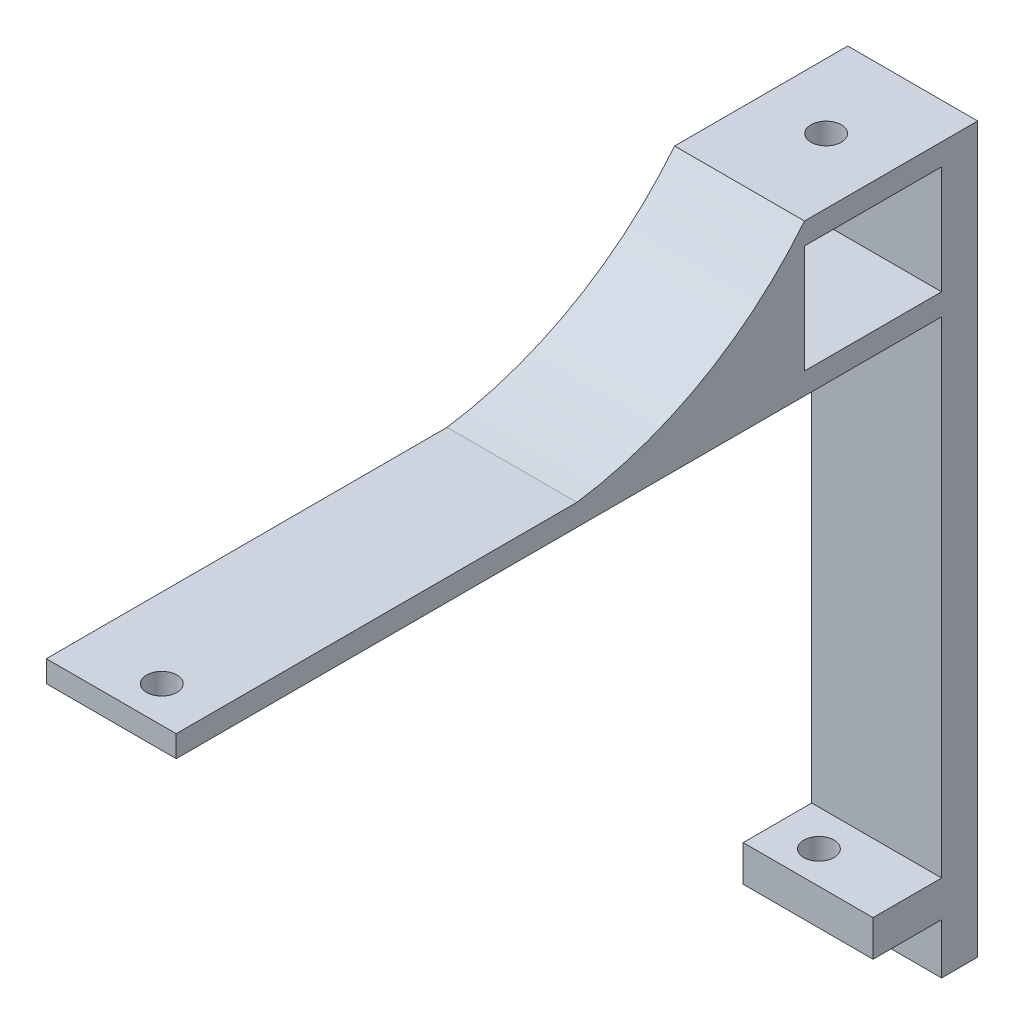
ISO-10303-21;
HEADER;
FILE_DESCRIPTION(('STEP AP214'),'2;1');
FILE_NAME('part.step','',(''),(''),'','','');
FILE_SCHEMA(('AUTOMOTIVE_DESIGN { 1 0 10303 214 1 1 1 1 }'));
ENDSEC;
DATA;
#1=APPLICATION_CONTEXT('core data for automotive mechanical design processes');
#2=APPLICATION_PROTOCOL_DEFINITION('international standard','automotive_design',2000,#1);
#3=PRODUCT_CONTEXT('',#1,'mechanical');
#4=PRODUCT('Part','Part','',(#3));
#5=PRODUCT_RELATED_PRODUCT_CATEGORY('part','',(#4));
#6=PRODUCT_DEFINITION_FORMATION('','',#4);
#7=PRODUCT_DEFINITION_CONTEXT('part definition',#1,'design');
#8=PRODUCT_DEFINITION('design','',#6,#7);
#9=PRODUCT_DEFINITION_SHAPE('','',#8);
#10=(LENGTH_UNIT() NAMED_UNIT(*) SI_UNIT(.MILLI.,.METRE.));
#11=(NAMED_UNIT(*) PLANE_ANGLE_UNIT() SI_UNIT($,.RADIAN.));
#12=(NAMED_UNIT(*) SI_UNIT($,.STERADIAN.) SOLID_ANGLE_UNIT());
#13=UNCERTAINTY_MEASURE_WITH_UNIT(LENGTH_MEASURE(1.E-05),#10,'distance_accuracy_value','');
#14=(GEOMETRIC_REPRESENTATION_CONTEXT(3) GLOBAL_UNCERTAINTY_ASSIGNED_CONTEXT((#13)) GLOBAL_UNIT_ASSIGNED_CONTEXT((#10,
#11,#12)) REPRESENTATION_CONTEXT('',''));
#15=CARTESIAN_POINT('',(0.,0.,0.));
#16=DIRECTION('',(0.,0.,1.));
#17=DIRECTION('',(1.,0.,0.));
#18=AXIS2_PLACEMENT_3D('',#15,#16,#17);
#19=CARTESIAN_POINT('',(52.,192.414352888303,0.));
#20=DIRECTION('',(0.,1.,0.));
#21=DIRECTION('',(0.,0.,1.));
#22=AXIS2_PLACEMENT_3D('',#19,#20,#21);
#23=PLANE('',#22);
#24=DIRECTION('',(1.,0.,0.));
#25=VECTOR('',#24,1.);
#26=CARTESIAN_POINT('',(-24.376584513286,192.414352888303,-32.6395852545773));
#27=LINE('',#26,#25);
#28=CARTESIAN_POINT('',(34.,192.414352888303,-32.6395852545773));
#29=VERTEX_POINT('',#28);
#30=CARTESIAN_POINT('',(52.,192.414352888303,-32.6395852545773));
#31=VERTEX_POINT('',#30);
#32=EDGE_CURVE('E308',#29,#31,#27,.T.);
#33=ORIENTED_EDGE('',*,*,#32,.F.);
#34=DIRECTION('',(0.,0.,-1.));
#35=VECTOR('',#34,1.);
#36=CARTESIAN_POINT('',(34.,192.414352888303,0.));
#37=LINE('',#36,#35);
#38=CARTESIAN_POINT('',(34.,192.414352888303,-13.6395852545773));
#39=VERTEX_POINT('',#38);
#40=EDGE_CURVE('E333',#39,#29,#37,.T.);
#41=ORIENTED_EDGE('',*,*,#40,.F.);
#42=DIRECTION('',(1.,0.,0.));
#43=VECTOR('',#42,1.);
#44=CARTESIAN_POINT('',(-24.376584513286,192.414352888303,-13.6395852545773));
#45=LINE('',#44,#43);
#46=CARTESIAN_POINT('',(52.,192.414352888303,-13.6395852545773));
#47=VERTEX_POINT('',#46);
#48=EDGE_CURVE('E89',#39,#47,#45,.T.);
#49=ORIENTED_EDGE('',*,*,#48,.T.);
#50=DIRECTION('',(0.,0.,-1.));
#51=VECTOR('',#50,1.);
#52=CARTESIAN_POINT('',(52.,192.414352888303,0.));
#53=LINE('',#52,#51);
#54=EDGE_CURVE('E270',#47,#31,#53,.T.);
#55=ORIENTED_EDGE('',*,*,#54,.T.);
#56=EDGE_LOOP('',(#33,#41,#49,#55));
#57=FACE_BOUND('',#56,.T.);
#58=ADVANCED_FACE('F65',(#57),#23,.T.);
#59=CARTESIAN_POINT('',(52.,0.,73.4248216350618));
#60=DIRECTION('',(0.,0.,-1.));
#61=DIRECTION('',(-1.,0.,0.));
#62=AXIS2_PLACEMENT_3D('',#59,#60,#61);
#63=PLANE('',#62);
#64=DIRECTION('',(-1.,0.,0.));
#65=VECTOR('',#64,1.);
#66=CARTESIAN_POINT('',(52.,192.414352888303,73.4248216350618));
#67=LINE('',#66,#65);
#68=CARTESIAN_POINT('',(52.,192.414352888303,73.4248216350618));
#69=VERTEX_POINT('',#68);
#70=CARTESIAN_POINT('',(34.,192.414352888303,73.4248216350618));
#71=VERTEX_POINT('',#70);
#72=EDGE_CURVE('E232',#69,#71,#67,.T.);
#73=ORIENTED_EDGE('',*,*,#72,.T.);
#74=DIRECTION('',(0.,-1.,0.));
#75=VECTOR('',#74,1.);
#76=CARTESIAN_POINT('',(34.,0.,73.4248216350618));
#77=LINE('',#76,#75);
#78=CARTESIAN_POINT('',(34.,189.414352888303,73.4248216350618));
#79=VERTEX_POINT('',#78);
#80=EDGE_CURVE('E227',#71,#79,#77,.T.);
#81=ORIENTED_EDGE('',*,*,#80,.T.);
#82=DIRECTION('',(-1.,0.,0.));
#83=VECTOR('',#82,1.);
#84=CARTESIAN_POINT('',(52.,189.414352888303,73.4248216350618));
#85=LINE('',#84,#83);
#86=CARTESIAN_POINT('',(52.,189.414352888303,73.4248216350618));
#87=VERTEX_POINT('',#86);
#88=EDGE_CURVE('E231',#87,#79,#85,.T.);
#89=ORIENTED_EDGE('',*,*,#88,.F.);
#90=DIRECTION('',(0.,-1.,0.));
#91=VECTOR('',#90,1.);
#92=CARTESIAN_POINT('',(52.,0.,73.4248216350618));
#93=LINE('',#92,#91);
#94=EDGE_CURVE('E222',#69,#87,#93,.T.);
#95=ORIENTED_EDGE('',*,*,#94,.F.);
#96=EDGE_LOOP('',(#73,#81,#89,#95));
#97=FACE_BOUND('',#96,.T.);
#98=ADVANCED_FACE('F67',(#97),#63,.F.);
#99=CARTESIAN_POINT('',(52.,189.414352888303,0.));
#100=DIRECTION('',(0.,1.,0.));
#101=DIRECTION('',(0.,0.,1.));
#102=AXIS2_PLACEMENT_3D('',#99,#100,#101);
#103=PLANE('',#102);
#104=CARTESIAN_POINT('',(45.,189.414352888303,68.4248216350618));
#105=DIRECTION('',(0.,1.,0.));
#106=DIRECTION('',(0.,0.,1.));
#107=AXIS2_PLACEMENT_3D('',#104,#105,#106);
#108=CIRCLE('',#107,2.1);
#109=CARTESIAN_POINT('',(45.,189.414352888303,70.5248216350618));
#110=VERTEX_POINT('',#109);
#111=EDGE_CURVE('E385',#110,#110,#108,.T.);
#112=ORIENTED_EDGE('',*,*,#111,.T.);
#113=EDGE_LOOP('',(#112));
#114=FACE_BOUND('',#113,.T.);
#115=ORIENTED_EDGE('',*,*,#88,.T.);
#116=DIRECTION('',(0.,0.,-1.));
#117=VECTOR('',#116,1.);
#118=CARTESIAN_POINT('',(34.,189.414352888303,0.));
#119=LINE('',#118,#117);
#120=CARTESIAN_POINT('',(34.,189.414352888303,-32.6395852545773));
#121=VERTEX_POINT('',#120);
#122=EDGE_CURVE('E217',#79,#121,#119,.T.);
#123=ORIENTED_EDGE('',*,*,#122,.T.);
#124=DIRECTION('',(-1.,0.,0.));
#125=VECTOR('',#124,1.);
#126=CARTESIAN_POINT('',(52.,189.414352888303,-32.6395852545773));
#127=LINE('',#126,#125);
#128=CARTESIAN_POINT('',(52.,189.414352888303,-32.6395852545773));
#129=VERTEX_POINT('',#128);
#130=EDGE_CURVE('E203',#129,#121,#127,.T.);
#131=ORIENTED_EDGE('',*,*,#130,.F.);
#132=DIRECTION('',(0.,0.,-1.));
#133=VECTOR('',#132,1.);
#134=CARTESIAN_POINT('',(52.,189.414352888303,0.));
#135=LINE('',#134,#133);
#136=EDGE_CURVE('E219',#87,#129,#135,.T.);
#137=ORIENTED_EDGE('',*,*,#136,.F.);
#138=EDGE_LOOP('',(#115,#123,#131,#137));
#139=FACE_BOUND('',#138,.T.);
#140=ADVANCED_FACE('F374',(#114,#139),#103,.F.);
#141=CARTESIAN_POINT('',(52.,0.,-32.6395852545773));
#142=DIRECTION('',(0.,0.,1.));
#143=DIRECTION('',(1.,0.,0.));
#144=AXIS2_PLACEMENT_3D('',#141,#142,#143);
#145=PLANE('',#144);
#146=DIRECTION('',(0.,1.,0.));
#147=VECTOR('',#146,1.);
#148=CARTESIAN_POINT('',(34.,0.,-32.6395852545773));
#149=LINE('',#148,#147);
#150=CARTESIAN_POINT('',(34.,122.064008857799,-32.6395852545773));
#151=VERTEX_POINT('',#150);
#152=EDGE_CURVE('E75',#151,#121,#149,.T.);
#153=ORIENTED_EDGE('',*,*,#152,.F.);
#154=DIRECTION('',(-1.,0.,0.));
#155=VECTOR('',#154,1.);
#156=CARTESIAN_POINT('',(52.,122.064008857799,-32.6395852545773));
#157=LINE('',#156,#155);
#158=CARTESIAN_POINT('',(52.,122.064008857799,-32.6395852545773));
#159=VERTEX_POINT('',#158);
#160=EDGE_CURVE('E202',#159,#151,#157,.T.);
#161=ORIENTED_EDGE('',*,*,#160,.F.);
#162=DIRECTION('',(0.,1.,0.));
#163=VECTOR('',#162,1.);
#164=CARTESIAN_POINT('',(52.,0.,-32.6395852545773));
#165=LINE('',#164,#163);
#166=EDGE_CURVE('E200',#159,#129,#165,.T.);
#167=ORIENTED_EDGE('',*,*,#166,.T.);
#168=ORIENTED_EDGE('',*,*,#130,.T.);
#169=EDGE_LOOP('',(#153,#161,#167,#168));
#170=FACE_BOUND('',#169,.T.);
#171=ADVANCED_FACE('F377',(#170),#145,.T.);
#172=CARTESIAN_POINT('',(52.,122.064008857799,0.));
#173=DIRECTION('',(0.,1.,0.));
#174=DIRECTION('',(0.,0.,1.));
#175=AXIS2_PLACEMENT_3D('',#172,#173,#174);
#176=PLANE('',#175);
#177=CARTESIAN_POINT('',(40.,122.064008857799,-27.6395852545773));
#178=DIRECTION('',(0.,1.,0.));
#179=DIRECTION('',(0.,0.,1.));
#180=AXIS2_PLACEMENT_3D('',#177,#178,#179);
#181=CIRCLE('',#180,2.1);
#182=CARTESIAN_POINT('',(40.,122.064008857799,-25.5395852545773));
#183=VERTEX_POINT('',#182);
#184=EDGE_CURVE('E590',#183,#183,#181,.T.);
#185=ORIENTED_EDGE('',*,*,#184,.F.);
#186=EDGE_LOOP('',(#185));
#187=FACE_BOUND('',#186,.T.);
#188=DIRECTION('',(-1.,0.,0.));
#189=VECTOR('',#188,1.);
#190=CARTESIAN_POINT('',(34.,122.064008857799,-23.1395852545773));
#191=LINE('',#190,#189);
#192=CARTESIAN_POINT('',(52.,122.064008857799,-23.1395852545773));
#193=VERTEX_POINT('',#192);
#194=CARTESIAN_POINT('',(34.,122.064008857799,-23.1395852545773));
#195=VERTEX_POINT('',#194);
#196=EDGE_CURVE('E82',#193,#195,#191,.T.);
#197=ORIENTED_EDGE('',*,*,#196,.F.);
#198=DIRECTION('',(0.,0.,-1.));
#199=VECTOR('',#198,1.);
#200=CARTESIAN_POINT('',(52.,122.064008857799,0.));
#201=LINE('',#200,#199);
#202=EDGE_CURVE('E191',#193,#159,#201,.T.);
#203=ORIENTED_EDGE('',*,*,#202,.T.);
#204=ORIENTED_EDGE('',*,*,#160,.T.);
#205=DIRECTION('',(0.,0.,-1.));
#206=VECTOR('',#205,1.);
#207=CARTESIAN_POINT('',(34.,122.064008857799,0.));
#208=LINE('',#207,#206);
#209=EDGE_CURVE('E193',#195,#151,#208,.T.);
#210=ORIENTED_EDGE('',*,*,#209,.F.);
#211=EDGE_LOOP('',(#197,#203,#204,#210));
#212=FACE_BOUND('',#211,.T.);
#213=ADVANCED_FACE('F189',(#187,#212),#176,.T.);
#214=CARTESIAN_POINT('',(52.,117.064008857799,0.));
#215=DIRECTION('',(0.,1.,0.));
#216=DIRECTION('',(0.,0.,1.));
#217=AXIS2_PLACEMENT_3D('',#214,#215,#216);
#218=PLANE('',#217);
#219=CARTESIAN_POINT('',(40.,117.064008857799,-27.6395852545773));
#220=DIRECTION('',(0.,1.,0.));
#221=DIRECTION('',(0.,0.,1.));
#222=AXIS2_PLACEMENT_3D('',#219,#220,#221);
#223=CIRCLE('',#222,2.1);
#224=CARTESIAN_POINT('',(40.,117.064008857799,-25.5395852545773));
#225=VERTEX_POINT('',#224);
#226=EDGE_CURVE('E69',#225,#225,#223,.T.);
#227=ORIENTED_EDGE('',*,*,#226,.T.);
#228=EDGE_LOOP('',(#227));
#229=FACE_BOUND('',#228,.T.);
#230=DIRECTION('',(0.,0.,-1.));
#231=VECTOR('',#230,1.);
#232=CARTESIAN_POINT('',(52.,117.064008857799,0.));
#233=LINE('',#232,#231);
#234=CARTESIAN_POINT('',(52.,117.064008857799,-23.1395852545773));
#235=VERTEX_POINT('',#234);
#236=CARTESIAN_POINT('',(52.,117.064008857799,-32.6395852545773));
#237=VERTEX_POINT('',#236);
#238=EDGE_CURVE('E213',#235,#237,#233,.T.);
#239=ORIENTED_EDGE('',*,*,#238,.F.);
#240=DIRECTION('',(-1.,0.,0.));
#241=VECTOR('',#240,1.);
#242=CARTESIAN_POINT('',(52.,117.064008857799,-23.1395852545773));
#243=LINE('',#242,#241);
#244=CARTESIAN_POINT('',(34.,117.064008857799,-23.1395852545773));
#245=VERTEX_POINT('',#244);
#246=EDGE_CURVE('E181',#235,#245,#243,.T.);
#247=ORIENTED_EDGE('',*,*,#246,.T.);
#248=DIRECTION('',(0.,0.,-1.));
#249=VECTOR('',#248,1.);
#250=CARTESIAN_POINT('',(34.,117.064008857799,0.));
#251=LINE('',#250,#249);
#252=CARTESIAN_POINT('',(34.,117.064008857799,-32.6395852545773));
#253=VERTEX_POINT('',#252);
#254=EDGE_CURVE('E207',#245,#253,#251,.T.);
#255=ORIENTED_EDGE('',*,*,#254,.T.);
#256=DIRECTION('',(-1.,0.,0.));
#257=VECTOR('',#256,1.);
#258=CARTESIAN_POINT('',(52.,117.064008857799,-32.6395852545773));
#259=LINE('',#258,#257);
#260=EDGE_CURVE('E252',#237,#253,#259,.T.);
#261=ORIENTED_EDGE('',*,*,#260,.F.);
#262=EDGE_LOOP('',(#239,#247,#255,#261));
#263=FACE_BOUND('',#262,.T.);
#264=ADVANCED_FACE('F379',(#229,#263),#218,.F.);
#265=DIRECTION('',(0.,1.,0.));
#266=VECTOR('',#265,1.);
#267=CARTESIAN_POINT('',(34.,0.,-32.6395852545773));
#268=LINE('',#267,#266);
#269=CARTESIAN_POINT('',(34.,110.064008857799,-32.6395852545773));
#270=VERTEX_POINT('',#269);
#271=EDGE_CURVE('E240',#270,#253,#268,.T.);
#272=ORIENTED_EDGE('',*,*,#271,.F.);
#273=DIRECTION('',(-1.,0.,0.));
#274=VECTOR('',#273,1.);
#275=CARTESIAN_POINT('',(52.,110.064008857799,-32.6395852545773));
#276=LINE('',#275,#274);
#277=CARTESIAN_POINT('',(52.,110.064008857799,-32.6395852545773));
#278=VERTEX_POINT('',#277);
#279=EDGE_CURVE('E262',#278,#270,#276,.T.);
#280=ORIENTED_EDGE('',*,*,#279,.F.);
#281=EDGE_CURVE('E218',#278,#237,#165,.T.);
#282=ORIENTED_EDGE('',*,*,#281,.T.);
#283=ORIENTED_EDGE('',*,*,#260,.T.);
#284=EDGE_LOOP('',(#272,#280,#282,#283));
#285=FACE_BOUND('',#284,.T.);
#286=ADVANCED_FACE('F351',(#285),#145,.T.);
#287=CARTESIAN_POINT('',(52.,110.064008857799,0.));
#288=DIRECTION('',(0.,-1.,0.));
#289=DIRECTION('',(0.,0.,-1.));
#290=AXIS2_PLACEMENT_3D('',#287,#288,#289);
#291=PLANE('',#290);
#292=DIRECTION('',(0.,0.,-1.));
#293=VECTOR('',#292,1.);
#294=CARTESIAN_POINT('',(34.,110.064008857799,86.3604147454227));
#295=LINE('',#294,#293);
#296=CARTESIAN_POINT('',(34.,110.064008857799,-37.6395852545773));
#297=VERTEX_POINT('',#296);
#298=EDGE_CURVE('E247',#270,#297,#295,.T.);
#299=ORIENTED_EDGE('',*,*,#298,.T.);
#300=DIRECTION('',(-1.,0.,0.));
#301=VECTOR('',#300,1.);
#302=CARTESIAN_POINT('',(52.,110.064008857799,-37.6395852545773));
#303=LINE('',#302,#301);
#304=CARTESIAN_POINT('',(52.,110.064008857799,-37.6395852545773));
#305=VERTEX_POINT('',#304);
#306=EDGE_CURVE('E266',#305,#297,#303,.T.);
#307=ORIENTED_EDGE('',*,*,#306,.F.);
#308=DIRECTION('',(0.,0.,1.));
#309=VECTOR('',#308,1.);
#310=CARTESIAN_POINT('',(52.,110.064008857799,0.));
#311=LINE('',#310,#309);
#312=EDGE_CURVE('E251',#305,#278,#311,.T.);
#313=ORIENTED_EDGE('',*,*,#312,.T.);
#314=ORIENTED_EDGE('',*,*,#279,.T.);
#315=EDGE_LOOP('',(#299,#307,#313,#314));
#316=FACE_BOUND('',#315,.T.);
#317=ADVANCED_FACE('F343',(#316),#291,.T.);
#318=CARTESIAN_POINT('',(52.,0.,-37.6395852545773));
#319=DIRECTION('',(0.,0.,1.));
#320=DIRECTION('',(1.,0.,0.));
#321=AXIS2_PLACEMENT_3D('',#318,#319,#320);
#322=PLANE('',#321);
#323=ORIENTED_EDGE('',*,*,#306,.T.);
#324=DIRECTION('',(0.,-1.,0.));
#325=VECTOR('',#324,1.);
#326=CARTESIAN_POINT('',(34.,0.,-37.6395852545773));
#327=LINE('',#326,#325);
#328=CARTESIAN_POINT('',(34.,210.414352888303,-37.6395852545773));
#329=VERTEX_POINT('',#328);
#330=EDGE_CURVE('E246',#329,#297,#327,.T.);
#331=ORIENTED_EDGE('',*,*,#330,.F.);
#332=DIRECTION('',(1.,0.,0.));
#333=VECTOR('',#332,1.);
#334=CARTESIAN_POINT('',(-24.376584513286,210.414352888303,-37.6395852545773));
#335=LINE('',#334,#333);
#336=CARTESIAN_POINT('',(52.,210.414352888303,-37.6395852545773));
#337=VERTEX_POINT('',#336);
#338=EDGE_CURVE('E324',#329,#337,#335,.T.);
#339=ORIENTED_EDGE('',*,*,#338,.T.);
#340=DIRECTION('',(0.,1.,0.));
#341=VECTOR('',#340,1.);
#342=CARTESIAN_POINT('',(52.,0.,-37.6395852545773));
#343=LINE('',#342,#341);
#344=EDGE_CURVE('E337',#305,#337,#343,.T.);
#345=ORIENTED_EDGE('',*,*,#344,.F.);
#346=EDGE_LOOP('',(#323,#331,#339,#345));
#347=FACE_BOUND('',#346,.T.);
#348=ADVANCED_FACE('F357',(#347),#322,.F.);
#349=CARTESIAN_POINT('',(45.,192.414352888303,68.4248216350618));
#350=DIRECTION('',(0.,1.,0.));
#351=DIRECTION('',(0.,0.,1.));
#352=AXIS2_PLACEMENT_3D('',#349,#350,#351);
#353=CIRCLE('',#352,2.1);
#354=CARTESIAN_POINT('',(45.,192.414352888303,70.5248216350618));
#355=VERTEX_POINT('',#354);
#356=EDGE_CURVE('E381',#355,#355,#353,.T.);
#357=ORIENTED_EDGE('',*,*,#356,.F.);
#358=EDGE_LOOP('',(#357));
#359=FACE_BOUND('',#358,.T.);
#360=DIRECTION('',(1.,0.,0.));
#361=VECTOR('',#360,1.);
#362=CARTESIAN_POINT('',(-24.376584513286,192.414352888303,17.8926181902422));
#363=LINE('',#362,#361);
#364=CARTESIAN_POINT('',(34.,192.414352888303,17.8926181902422));
#365=VERTEX_POINT('',#364);
#366=CARTESIAN_POINT('',(52.,192.414352888303,17.8926181902422));
#367=VERTEX_POINT('',#366);
#368=EDGE_CURVE('E318',#365,#367,#363,.T.);
#369=ORIENTED_EDGE('',*,*,#368,.F.);
#370=EDGE_CURVE('E255',#71,#365,#37,.T.);
#371=ORIENTED_EDGE('',*,*,#370,.F.);
#372=ORIENTED_EDGE('',*,*,#72,.F.);
#373=EDGE_CURVE('E226',#69,#367,#53,.T.);
#374=ORIENTED_EDGE('',*,*,#373,.T.);
#375=EDGE_LOOP('',(#369,#371,#372,#374));
#376=FACE_BOUND('',#375,.T.);
#377=ADVANCED_FACE('F369',(#359,#376),#23,.T.);
#378=CARTESIAN_POINT('',(52.,0.,0.));
#379=DIRECTION('',(1.,0.,0.));
#380=DIRECTION('',(0.,0.,-1.));
#381=AXIS2_PLACEMENT_3D('',#378,#379,#380);
#382=PLANE('',#381);
#383=DIRECTION('',(0.,1.,0.));
#384=VECTOR('',#383,1.);
#385=CARTESIAN_POINT('',(52.,54.0640088577995,-23.1395852545773));
#386=LINE('',#385,#384);
#387=EDGE_CURVE('E178',#235,#193,#386,.T.);
#388=ORIENTED_EDGE('',*,*,#387,.F.);
#389=ORIENTED_EDGE('',*,*,#238,.T.);
#390=ORIENTED_EDGE('',*,*,#281,.F.);
#391=ORIENTED_EDGE('',*,*,#312,.F.);
#392=ORIENTED_EDGE('',*,*,#344,.T.);
#393=DIRECTION('',(0.,0.,1.));
#394=VECTOR('',#393,1.);
#395=CARTESIAN_POINT('',(52.,210.414352888303,-37.6395852545773));
#396=LINE('',#395,#394);
#397=CARTESIAN_POINT('',(52.,210.414352888303,-13.6395852545773));
#398=VERTEX_POINT('',#397);
#399=EDGE_CURVE('E291',#337,#398,#396,.T.);
#400=ORIENTED_EDGE('',*,*,#399,.T.);
#401=CARTESIAN_POINT('',(52.,241.587789104786,25.0593208042666));
#402=DIRECTION('',(-1.,0.,0.));
#403=DIRECTION('',(0.,0.,1.));
#404=AXIS2_PLACEMENT_3D('',#401,#402,#403);
#405=CIRCLE('',#404,49.6929417090024);
#406=EDGE_CURVE('E296',#398,#367,#405,.T.);
#407=ORIENTED_EDGE('',*,*,#406,.T.);
#408=ORIENTED_EDGE('',*,*,#373,.F.);
#409=ORIENTED_EDGE('',*,*,#94,.T.);
#410=ORIENTED_EDGE('',*,*,#136,.T.);
#411=ORIENTED_EDGE('',*,*,#166,.F.);
#412=ORIENTED_EDGE('',*,*,#202,.F.);
#413=EDGE_LOOP('',(#388,#389,#390,#391,#392,#400,#407,#408,#409,#410,#411,#412));
#414=FACE_BOUND('',#413,.T.);
#415=ORIENTED_EDGE('',*,*,#54,.F.);
#416=DIRECTION('',(0.,1.,0.));
#417=VECTOR('',#416,1.);
#418=CARTESIAN_POINT('',(52.,207.414352888303,-13.6395852545773));
#419=LINE('',#418,#417);
#420=CARTESIAN_POINT('',(52.,207.414352888303,-13.6395852545773));
#421=VERTEX_POINT('',#420);
#422=EDGE_CURVE('E300',#47,#421,#419,.T.);
#423=ORIENTED_EDGE('',*,*,#422,.T.);
#424=DIRECTION('',(0.,0.,-1.));
#425=VECTOR('',#424,1.);
#426=CARTESIAN_POINT('',(52.,207.414352888303,-32.6395852545773));
#427=LINE('',#426,#425);
#428=CARTESIAN_POINT('',(52.,207.414352888303,-32.6395852545773));
#429=VERTEX_POINT('',#428);
#430=EDGE_CURVE('E304',#421,#429,#427,.T.);
#431=ORIENTED_EDGE('',*,*,#430,.T.);
#432=DIRECTION('',(0.,-1.,0.));
#433=VECTOR('',#432,1.);
#434=CARTESIAN_POINT('',(52.,192.414352888303,-32.6395852545773));
#435=LINE('',#434,#433);
#436=EDGE_CURVE('E287',#429,#31,#435,.T.);
#437=ORIENTED_EDGE('',*,*,#436,.T.);
#438=EDGE_LOOP('',(#415,#423,#431,#437));
#439=FACE_BOUND('',#438,.T.);
#440=ADVANCED_FACE('F197',(#414,#439),#382,.T.);
#441=CARTESIAN_POINT('',(34.,0.,86.3604147454227));
#442=DIRECTION('',(1.,0.,0.));
#443=DIRECTION('',(0.,1.,0.));
#444=AXIS2_PLACEMENT_3D('',#441,#442,#443);
#445=PLANE('',#444);
#446=ORIENTED_EDGE('',*,*,#254,.F.);
#447=DIRECTION('',(0.,1.,0.));
#448=VECTOR('',#447,1.);
#449=CARTESIAN_POINT('',(34.,0.,-23.1395852545773));
#450=LINE('',#449,#448);
#451=EDGE_CURVE('E12',#245,#195,#450,.T.);
#452=ORIENTED_EDGE('',*,*,#451,.T.);
#453=ORIENTED_EDGE('',*,*,#209,.T.);
#454=ORIENTED_EDGE('',*,*,#152,.T.);
#455=ORIENTED_EDGE('',*,*,#122,.F.);
#456=ORIENTED_EDGE('',*,*,#80,.F.);
#457=ORIENTED_EDGE('',*,*,#370,.T.);
#458=CARTESIAN_POINT('',(34.,241.587789104786,25.0593208042666));
#459=DIRECTION('',(1.,0.,0.));
#460=DIRECTION('',(0.,1.,0.));
#461=AXIS2_PLACEMENT_3D('',#458,#459,#460);
#462=CIRCLE('',#461,49.6929417090024);
#463=CARTESIAN_POINT('',(34.,210.414352888303,-13.6395852545773));
#464=VERTEX_POINT('',#463);
#465=EDGE_CURVE('E400',#365,#464,#462,.T.);
#466=ORIENTED_EDGE('',*,*,#465,.T.);
#467=DIRECTION('',(0.,0.,-1.));
#468=VECTOR('',#467,1.);
#469=CARTESIAN_POINT('',(34.,210.414352888303,-37.6395852545773));
#470=LINE('',#469,#468);
#471=EDGE_CURVE('E312',#464,#329,#470,.T.);
#472=ORIENTED_EDGE('',*,*,#471,.T.);
#473=ORIENTED_EDGE('',*,*,#330,.T.);
#474=ORIENTED_EDGE('',*,*,#298,.F.);
#475=ORIENTED_EDGE('',*,*,#271,.T.);
#476=EDGE_LOOP('',(#446,#452,#453,#454,#455,#456,#457,#466,#472,#473,#474,#475));
#477=FACE_BOUND('',#476,.T.);
#478=DIRECTION('',(0.,-1.,0.));
#479=VECTOR('',#478,1.);
#480=CARTESIAN_POINT('',(34.,207.414352888303,-13.6395852545773));
#481=LINE('',#480,#479);
#482=CARTESIAN_POINT('',(34.,207.414352888303,-13.6395852545773));
#483=VERTEX_POINT('',#482);
#484=EDGE_CURVE('E283',#483,#39,#481,.T.);
#485=ORIENTED_EDGE('',*,*,#484,.T.);
#486=ORIENTED_EDGE('',*,*,#40,.T.);
#487=DIRECTION('',(0.,1.,0.));
#488=VECTOR('',#487,1.);
#489=CARTESIAN_POINT('',(34.,192.414352888303,-32.6395852545773));
#490=LINE('',#489,#488);
#491=CARTESIAN_POINT('',(34.,207.414352888303,-32.6395852545773));
#492=VERTEX_POINT('',#491);
#493=EDGE_CURVE('E273',#29,#492,#490,.T.);
#494=ORIENTED_EDGE('',*,*,#493,.T.);
#495=DIRECTION('',(0.,0.,1.));
#496=VECTOR('',#495,1.);
#497=CARTESIAN_POINT('',(34.,207.414352888303,-32.6395852545773));
#498=LINE('',#497,#496);
#499=EDGE_CURVE('E277',#492,#483,#498,.T.);
#500=ORIENTED_EDGE('',*,*,#499,.T.);
#501=EDGE_LOOP('',(#485,#486,#494,#500));
#502=FACE_BOUND('',#501,.T.);
#503=ADVANCED_FACE('F354',(#477,#502),#445,.F.);
#504=CARTESIAN_POINT('',(-24.376584513286,192.414352888303,-32.6395852545773));
#505=DIRECTION('',(0.,0.,1.));
#506=DIRECTION('',(1.,0.,0.));
#507=AXIS2_PLACEMENT_3D('',#504,#505,#506);
#508=PLANE('',#507);
#509=ORIENTED_EDGE('',*,*,#493,.F.);
#510=ORIENTED_EDGE('',*,*,#32,.T.);
#511=ORIENTED_EDGE('',*,*,#436,.F.);
#512=DIRECTION('',(1.,0.,0.));
#513=VECTOR('',#512,1.);
#514=CARTESIAN_POINT('',(-24.376584513286,207.414352888303,-32.6395852545773));
#515=LINE('',#514,#513);
#516=EDGE_CURVE('E309',#492,#429,#515,.T.);
#517=ORIENTED_EDGE('',*,*,#516,.F.);
#518=EDGE_LOOP('',(#509,#510,#511,#517));
#519=FACE_BOUND('',#518,.T.);
#520=ADVANCED_FACE('F416',(#519),#508,.T.);
#521=CARTESIAN_POINT('',(-24.376584513286,207.414352888303,-32.6395852545773));
#522=DIRECTION('',(0.,-1.,0.));
#523=DIRECTION('',(0.,0.,-1.));
#524=AXIS2_PLACEMENT_3D('',#521,#522,#523);
#525=PLANE('',#524);
#526=CARTESIAN_POINT('',(43.,207.414352888303,-25.6395852545773));
#527=DIRECTION('',(0.,-1.,0.));
#528=DIRECTION('',(0.,0.,-1.));
#529=AXIS2_PLACEMENT_3D('',#526,#527,#528);
#530=CIRCLE('',#529,2.1);
#531=CARTESIAN_POINT('',(43.,207.414352888303,-27.7395852545773));
#532=VERTEX_POINT('',#531);
#533=EDGE_CURVE('E292',#532,#532,#530,.T.);
#534=ORIENTED_EDGE('',*,*,#533,.F.);
#535=EDGE_LOOP('',(#534));
#536=FACE_BOUND('',#535,.T.);
#537=ORIENTED_EDGE('',*,*,#499,.F.);
#538=ORIENTED_EDGE('',*,*,#516,.T.);
#539=ORIENTED_EDGE('',*,*,#430,.F.);
#540=DIRECTION('',(1.,0.,0.));
#541=VECTOR('',#540,1.);
#542=CARTESIAN_POINT('',(-24.376584513286,207.414352888303,-13.6395852545773));
#543=LINE('',#542,#541);
#544=EDGE_CURVE('E313',#483,#421,#543,.T.);
#545=ORIENTED_EDGE('',*,*,#544,.F.);
#546=EDGE_LOOP('',(#537,#538,#539,#545));
#547=FACE_BOUND('',#546,.T.);
#548=ADVANCED_FACE('F418',(#536,#547),#525,.T.);
#549=CARTESIAN_POINT('',(-24.376584513286,207.414352888303,-13.6395852545773));
#550=DIRECTION('',(0.,0.,-1.));
#551=DIRECTION('',(0.,1.,0.));
#552=AXIS2_PLACEMENT_3D('',#549,#550,#551);
#553=PLANE('',#552);
#554=ORIENTED_EDGE('',*,*,#484,.F.);
#555=ORIENTED_EDGE('',*,*,#544,.T.);
#556=ORIENTED_EDGE('',*,*,#422,.F.);
#557=ORIENTED_EDGE('',*,*,#48,.F.);
#558=EDGE_LOOP('',(#554,#555,#556,#557));
#559=FACE_BOUND('',#558,.T.);
#560=ADVANCED_FACE('F419',(#559),#553,.T.);
#561=CARTESIAN_POINT('',(-24.376584513286,241.587789104786,25.0593208042666));
#562=DIRECTION('',(1.,0.,0.));
#563=DIRECTION('',(0.,0.,-1.));
#564=AXIS2_PLACEMENT_3D('',#561,#562,#563);
#565=CYLINDRICAL_SURFACE('',#564,49.6929417090024);
#566=ORIENTED_EDGE('',*,*,#465,.F.);
#567=ORIENTED_EDGE('',*,*,#368,.T.);
#568=ORIENTED_EDGE('',*,*,#406,.F.);
#569=DIRECTION('',(1.,0.,0.));
#570=VECTOR('',#569,1.);
#571=CARTESIAN_POINT('',(-24.376584513286,210.414352888303,-13.6395852545773));
#572=LINE('',#571,#570);
#573=EDGE_CURVE('E321',#464,#398,#572,.T.);
#574=ORIENTED_EDGE('',*,*,#573,.F.);
#575=EDGE_LOOP('',(#566,#567,#568,#574));
#576=FACE_BOUND('',#575,.T.);
#577=ADVANCED_FACE('F421',(#576),#565,.F.);
#578=CARTESIAN_POINT('',(-24.376584513286,210.414352888303,-37.6395852545773));
#579=DIRECTION('',(0.,1.,0.));
#580=DIRECTION('',(0.,0.,1.));
#581=AXIS2_PLACEMENT_3D('',#578,#579,#580);
#582=PLANE('',#581);
#583=CARTESIAN_POINT('',(43.,210.414352888303,-25.6395852545773));
#584=DIRECTION('',(0.,1.,0.));
#585=DIRECTION('',(0.,0.,1.));
#586=AXIS2_PLACEMENT_3D('',#583,#584,#585);
#587=CIRCLE('',#586,2.1);
#588=CARTESIAN_POINT('',(43.,210.414352888303,-23.5395852545773));
#589=VERTEX_POINT('',#588);
#590=EDGE_CURVE('E391',#589,#589,#587,.T.);
#591=ORIENTED_EDGE('',*,*,#590,.F.);
#592=EDGE_LOOP('',(#591));
#593=FACE_BOUND('',#592,.T.);
#594=ORIENTED_EDGE('',*,*,#471,.F.);
#595=ORIENTED_EDGE('',*,*,#573,.T.);
#596=ORIENTED_EDGE('',*,*,#399,.F.);
#597=ORIENTED_EDGE('',*,*,#338,.F.);
#598=EDGE_LOOP('',(#594,#595,#596,#597));
#599=FACE_BOUND('',#598,.T.);
#600=ADVANCED_FACE('F362',(#593,#599),#582,.T.);
#601=CARTESIAN_POINT('',(43.,199.414352888303,-25.6395852545773));
#602=DIRECTION('',(0.,1.,0.));
#603=DIRECTION('',(0.,0.,1.));
#604=AXIS2_PLACEMENT_3D('',#601,#602,#603);
#605=CYLINDRICAL_SURFACE('',#604,2.1);
#606=ORIENTED_EDGE('',*,*,#533,.T.);
#607=EDGE_LOOP('',(#606));
#608=FACE_BOUND('',#607,.T.);
#609=ORIENTED_EDGE('',*,*,#590,.T.);
#610=EDGE_LOOP('',(#609));
#611=FACE_BOUND('',#610,.T.);
#612=ADVANCED_FACE('F449',(#608,#611),#605,.F.);
#613=CARTESIAN_POINT('',(45.,124.414352888303,68.4248216350618));
#614=DIRECTION('',(0.,1.,0.));
#615=DIRECTION('',(0.,0.,1.));
#616=AXIS2_PLACEMENT_3D('',#613,#614,#615);
#617=CYLINDRICAL_SURFACE('',#616,2.1);
#618=ORIENTED_EDGE('',*,*,#356,.T.);
#619=EDGE_LOOP('',(#618));
#620=FACE_BOUND('',#619,.T.);
#621=ORIENTED_EDGE('',*,*,#111,.F.);
#622=EDGE_LOOP('',(#621));
#623=FACE_BOUND('',#622,.T.);
#624=ADVANCED_FACE('F446',(#620,#623),#617,.F.);
#625=CARTESIAN_POINT('',(34.,54.0640088577995,-23.1395852545773));
#626=DIRECTION('',(0.,0.,-1.));
#627=DIRECTION('',(-1.,0.,0.));
#628=AXIS2_PLACEMENT_3D('',#625,#626,#627);
#629=PLANE('',#628);
#630=ORIENTED_EDGE('',*,*,#387,.T.);
#631=ORIENTED_EDGE('',*,*,#196,.T.);
#632=ORIENTED_EDGE('',*,*,#451,.F.);
#633=ORIENTED_EDGE('',*,*,#246,.F.);
#634=EDGE_LOOP('',(#630,#631,#632,#633));
#635=FACE_BOUND('',#634,.T.);
#636=ADVANCED_FACE('F179',(#635),#629,.F.);
#637=CARTESIAN_POINT('',(40.,112.064008857799,-27.6395852545773));
#638=DIRECTION('',(0.,1.,0.));
#639=DIRECTION('',(0.,0.,1.));
#640=AXIS2_PLACEMENT_3D('',#637,#638,#639);
#641=CYLINDRICAL_SURFACE('',#640,2.1);
#642=ORIENTED_EDGE('',*,*,#184,.T.);
#643=EDGE_LOOP('',(#642));
#644=FACE_BOUND('',#643,.T.);
#645=ORIENTED_EDGE('',*,*,#226,.F.);
#646=EDGE_LOOP('',(#645));
#647=FACE_BOUND('',#646,.T.);
#648=ADVANCED_FACE('F562',(#644,#647),#641,.F.);
#649=CLOSED_SHELL('',(#58,#98,#140,#171,#213,#264,#286,#317,#348,#377,#440,#503,#520,#548,#560,
#577,#600,#612,#624,#636,#648));
#650=MANIFOLD_SOLID_BREP('B2',#649);
#651=ADVANCED_BREP_SHAPE_REPRESENTATION('',(#18,#650),#14);
#652=SHAPE_DEFINITION_REPRESENTATION(#9,#651);
ENDSEC;
END-ISO-10303-21;
